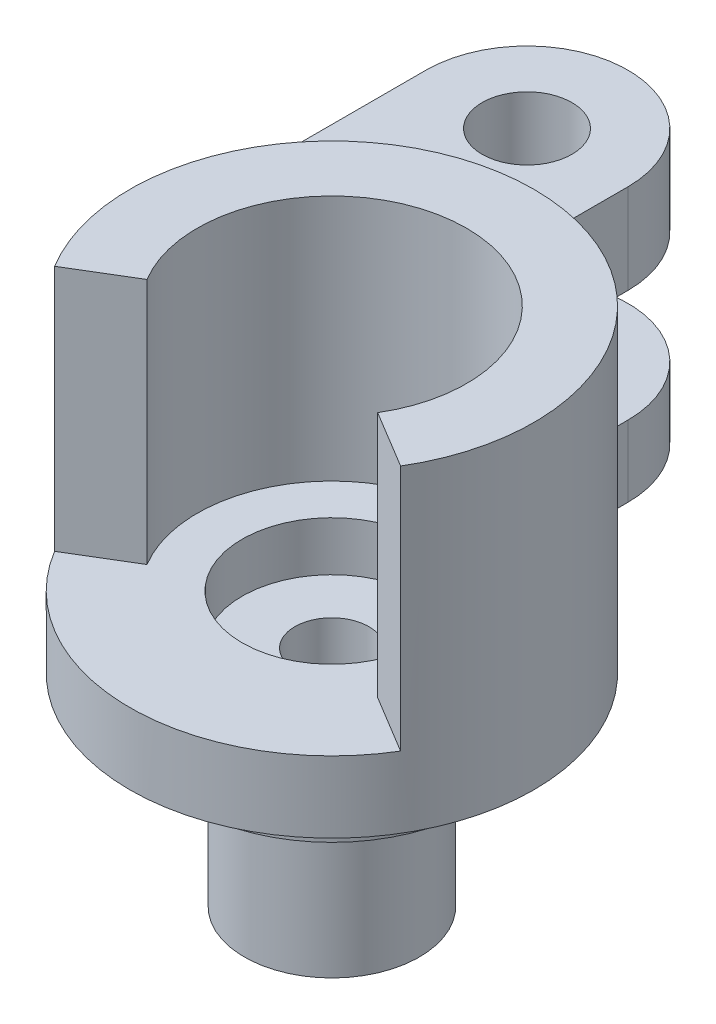
ISO-10303-21;
HEADER;
FILE_DESCRIPTION(('STEP AP214'),'2;1');
FILE_NAME('part.step','',(''),(''),'','','');
FILE_SCHEMA(('AUTOMOTIVE_DESIGN { 1 0 10303 214 1 1 1 1 }'));
ENDSEC;
DATA;
#1=APPLICATION_CONTEXT('core data for automotive mechanical design processes');
#2=APPLICATION_PROTOCOL_DEFINITION('international standard','automotive_design',2000,#1);
#3=PRODUCT_CONTEXT('',#1,'mechanical');
#4=PRODUCT('Part','Part','',(#3));
#5=PRODUCT_RELATED_PRODUCT_CATEGORY('part','',(#4));
#6=PRODUCT_DEFINITION_FORMATION('','',#4);
#7=PRODUCT_DEFINITION_CONTEXT('part definition',#1,'design');
#8=PRODUCT_DEFINITION('design','',#6,#7);
#9=PRODUCT_DEFINITION_SHAPE('','',#8);
#10=(LENGTH_UNIT() NAMED_UNIT(*) SI_UNIT(.MILLI.,.METRE.));
#11=(NAMED_UNIT(*) PLANE_ANGLE_UNIT() SI_UNIT($,.RADIAN.));
#12=(NAMED_UNIT(*) SI_UNIT($,.STERADIAN.) SOLID_ANGLE_UNIT());
#13=UNCERTAINTY_MEASURE_WITH_UNIT(LENGTH_MEASURE(1.E-05),#10,'distance_accuracy_value','');
#14=(GEOMETRIC_REPRESENTATION_CONTEXT(3) GLOBAL_UNCERTAINTY_ASSIGNED_CONTEXT((#13)) GLOBAL_UNIT_ASSIGNED_CONTEXT((#10,
#11,#12)) REPRESENTATION_CONTEXT('',''));
#15=CARTESIAN_POINT('',(0.,0.,0.));
#16=DIRECTION('',(0.,0.,1.));
#17=DIRECTION('',(1.,0.,0.));
#18=AXIS2_PLACEMENT_3D('',#15,#16,#17);
#19=CARTESIAN_POINT('',(0.,-13.6669047975957,0.));
#20=DIRECTION('',(0.,1.,0.));
#21=DIRECTION('',(0.,0.,1.));
#22=AXIS2_PLACEMENT_3D('',#19,#20,#21);
#23=CYLINDRICAL_SURFACE('',#22,1.650000048);
#24=CARTESIAN_POINT('',(0.,-8.999999906,0.));
#25=DIRECTION('',(0.,-1.,0.));
#26=DIRECTION('',(0.,0.,-1.));
#27=AXIS2_PLACEMENT_3D('',#24,#25,#26);
#28=CIRCLE('',#27,1.650000048);
#29=CARTESIAN_POINT('',(0.,-8.999999906,-1.650000048));
#30=VERTEX_POINT('',#29);
#31=EDGE_CURVE('E578',#30,#30,#28,.F.);
#32=ORIENTED_EDGE('',*,*,#31,.F.);
#33=EDGE_LOOP('',(#32));
#34=FACE_BOUND('',#33,.T.);
#35=CARTESIAN_POINT('',(0.,0.975,0.));
#36=DIRECTION('',(0.,1.,0.));
#37=DIRECTION('',(0.,0.,1.));
#38=AXIS2_PLACEMENT_3D('',#35,#36,#37);
#39=CIRCLE('',#38,1.650000048);
#40=CARTESIAN_POINT('',(0.,0.975,1.650000048));
#41=VERTEX_POINT('',#40);
#42=EDGE_CURVE('E41',#41,#41,#39,.F.);
#43=ORIENTED_EDGE('',*,*,#42,.F.);
#44=EDGE_LOOP('',(#43));
#45=FACE_BOUND('',#44,.T.);
#46=ADVANCED_FACE('F37',(#34,#45),#23,.F.);
#47=CARTESIAN_POINT('',(0.,3.175,0.));
#48=DIRECTION('',(0.,-1.,0.));
#49=DIRECTION('',(0.,0.,-1.));
#50=AXIS2_PLACEMENT_3D('',#47,#48,#49);
#51=CYLINDRICAL_SURFACE('',#50,9.);
#52=DIRECTION('',(0.,-1.,0.));
#53=VECTOR('',#52,1.);
#54=CARTESIAN_POINT('',(0.,12.174999906,-9.));
#55=LINE('',#54,#53);
#56=CARTESIAN_POINT('',(0.,12.174999906,-9.));
#57=VERTEX_POINT('',#56);
#58=CARTESIAN_POINT('',(0.,8.174999906,-9.));
#59=VERTEX_POINT('',#58);
#60=EDGE_CURVE('E54',#57,#59,#55,.T.);
#61=ORIENTED_EDGE('',*,*,#60,.F.);
#62=CARTESIAN_POINT('',(0.,12.174999906,0.));
#63=DIRECTION('',(0.,-1.,0.));
#64=DIRECTION('',(0.,0.,1.));
#65=AXIS2_PLACEMENT_3D('',#62,#63,#64);
#66=CIRCLE('',#65,9.);
#67=CARTESIAN_POINT('',(-9.,12.174999906,0.));
#68=VERTEX_POINT('',#67);
#69=EDGE_CURVE('E59',#68,#57,#66,.T.);
#70=ORIENTED_EDGE('',*,*,#69,.F.);
#71=DIRECTION('',(0.,-1.,0.));
#72=VECTOR('',#71,1.);
#73=CARTESIAN_POINT('',(-9.,12.174999906,0.));
#74=LINE('',#73,#72);
#75=CARTESIAN_POINT('',(-9.,8.174999906,0.));
#76=VERTEX_POINT('',#75);
#77=EDGE_CURVE('E147',#68,#76,#74,.T.);
#78=ORIENTED_EDGE('',*,*,#77,.T.);
#79=CARTESIAN_POINT('',(0.,8.174999906,0.));
#80=DIRECTION('',(0.,-1.,0.));
#81=DIRECTION('',(0.,0.,1.));
#82=AXIS2_PLACEMENT_3D('',#79,#80,#81);
#83=CIRCLE('',#82,9.);
#84=EDGE_CURVE('E151',#76,#59,#83,.T.);
#85=ORIENTED_EDGE('',*,*,#84,.T.);
#86=EDGE_LOOP('',(#61,#70,#78,#85));
#87=FACE_BOUND('',#86,.T.);
#88=CARTESIAN_POINT('',(0.,3.175,0.));
#89=DIRECTION('',(0.,1.,0.));
#90=DIRECTION('',(0.,0.,1.));
#91=AXIS2_PLACEMENT_3D('',#88,#89,#90);
#92=CIRCLE('',#91,9.);
#93=CARTESIAN_POINT('',(-7.70770438364841,3.175,4.64664321142554));
#94=VERTEX_POINT('',#93);
#95=CARTESIAN_POINT('',(7.70770438364841,3.175,4.64664321142554));
#96=VERTEX_POINT('',#95);
#97=EDGE_CURVE('E203',#94,#96,#92,.T.);
#98=ORIENTED_EDGE('',*,*,#97,.F.);
#99=DIRECTION('',(0.,-1.,0.));
#100=VECTOR('',#99,1.);
#101=CARTESIAN_POINT('',(-7.70770438364841,14.175,4.64664321142554));
#102=LINE('',#101,#100);
#103=CARTESIAN_POINT('',(-7.70770438364841,14.175,4.64664321142554));
#104=VERTEX_POINT('',#103);
#105=EDGE_CURVE('E230',#104,#94,#102,.T.);
#106=ORIENTED_EDGE('',*,*,#105,.F.);
#107=CARTESIAN_POINT('',(0.,14.175,0.));
#108=DIRECTION('',(0.,1.,0.));
#109=DIRECTION('',(0.,0.,-1.));
#110=AXIS2_PLACEMENT_3D('',#107,#108,#109);
#111=CIRCLE('',#110,9.);
#112=CARTESIAN_POINT('',(7.70770438364841,14.175,4.64664321142554));
#113=VERTEX_POINT('',#112);
#114=EDGE_CURVE('E204',#113,#104,#111,.T.);
#115=ORIENTED_EDGE('',*,*,#114,.F.);
#116=DIRECTION('',(0.,-1.,0.));
#117=VECTOR('',#116,1.);
#118=CARTESIAN_POINT('',(7.70770438364841,14.175,4.64664321142554));
#119=LINE('',#118,#117);
#120=EDGE_CURVE('E214',#113,#96,#119,.T.);
#121=ORIENTED_EDGE('',*,*,#120,.T.);
#122=EDGE_LOOP('',(#98,#106,#115,#121));
#123=FACE_BOUND('',#122,.T.);
#124=DIRECTION('',(0.,-1.,0.));
#125=VECTOR('',#124,1.);
#126=CARTESIAN_POINT('',(0.,23.0265647372949,-9.));
#127=LINE('',#126,#125);
#128=CARTESIAN_POINT('',(0.,3.175,-9.));
#129=VERTEX_POINT('',#128);
#130=CARTESIAN_POINT('',(0.,0.,-9.));
#131=VERTEX_POINT('',#130);
#132=EDGE_CURVE('E176',#129,#131,#127,.T.);
#133=ORIENTED_EDGE('',*,*,#132,.F.);
#134=CARTESIAN_POINT('',(0.,3.175,0.));
#135=DIRECTION('',(0.,1.,0.));
#136=DIRECTION('',(0.,0.,1.));
#137=AXIS2_PLACEMENT_3D('',#134,#135,#136);
#138=CIRCLE('',#137,9.);
#139=CARTESIAN_POINT('',(-9.,3.175,0.));
#140=VERTEX_POINT('',#139);
#141=EDGE_CURVE('E184',#140,#129,#138,.F.);
#142=ORIENTED_EDGE('',*,*,#141,.F.);
#143=DIRECTION('',(0.,-1.,0.));
#144=VECTOR('',#143,1.);
#145=CARTESIAN_POINT('',(-9.,23.0265647372949,0.));
#146=LINE('',#145,#144);
#147=CARTESIAN_POINT('',(-9.,0.,0.));
#148=VERTEX_POINT('',#147);
#149=EDGE_CURVE('E163',#140,#148,#146,.T.);
#150=ORIENTED_EDGE('',*,*,#149,.T.);
#151=CARTESIAN_POINT('',(0.,0.,0.));
#152=DIRECTION('',(0.,1.,0.));
#153=DIRECTION('',(0.,0.,1.));
#154=AXIS2_PLACEMENT_3D('',#151,#152,#153);
#155=CIRCLE('',#154,9.);
#156=EDGE_CURVE('E233',#148,#131,#155,.T.);
#157=ORIENTED_EDGE('',*,*,#156,.T.);
#158=EDGE_LOOP('',(#133,#142,#150,#157));
#159=FACE_BOUND('',#158,.T.);
#160=ADVANCED_FACE('F39',(#87,#123,#159),#51,.T.);
#161=CARTESIAN_POINT('',(0.,3.175,0.));
#162=DIRECTION('',(0.,1.,0.));
#163=DIRECTION('',(0.,0.,1.));
#164=AXIS2_PLACEMENT_3D('',#161,#162,#163);
#165=PLANE('',#164);
#166=CARTESIAN_POINT('',(0.,3.175,0.));
#167=DIRECTION('',(0.,1.,0.));
#168=DIRECTION('',(0.,0.,1.));
#169=AXIS2_PLACEMENT_3D('',#166,#167,#168);
#170=CIRCLE('',#169,4.);
#171=CARTESIAN_POINT('',(0.,3.175,4.));
#172=VERTEX_POINT('',#171);
#173=EDGE_CURVE('E557',#172,#172,#170,.T.);
#174=ORIENTED_EDGE('',*,*,#173,.F.);
#175=EDGE_LOOP('',(#174));
#176=FACE_BOUND('',#175,.T.);
#177=DIRECTION('',(0.856411598183157,0.,0.516293690158394));
#178=VECTOR('',#177,1.);
#179=CARTESIAN_POINT('',(5.13846958909894,3.175,3.09776214095036));
#180=LINE('',#179,#178);
#181=CARTESIAN_POINT('',(5.13846958909894,3.175,3.09776214095036));
#182=VERTEX_POINT('',#181);
#183=EDGE_CURVE('E208',#182,#96,#180,.T.);
#184=ORIENTED_EDGE('',*,*,#183,.F.);
#185=CARTESIAN_POINT('',(0.,3.175,0.));
#186=DIRECTION('',(0.,-1.,0.));
#187=DIRECTION('',(0.,0.,-1.));
#188=AXIS2_PLACEMENT_3D('',#185,#186,#187);
#189=CIRCLE('',#188,6.);
#190=CARTESIAN_POINT('',(-5.13846958909894,3.175,3.09776214095036));
#191=VERTEX_POINT('',#190);
#192=EDGE_CURVE('E217',#191,#182,#189,.T.);
#193=ORIENTED_EDGE('',*,*,#192,.F.);
#194=DIRECTION('',(0.856411598183157,0.,-0.516293690158393));
#195=VECTOR('',#194,1.);
#196=CARTESIAN_POINT('',(-7.70770438364841,3.175,4.64664321142554));
#197=LINE('',#196,#195);
#198=EDGE_CURVE('E200',#94,#191,#197,.T.);
#199=ORIENTED_EDGE('',*,*,#198,.F.);
#200=ORIENTED_EDGE('',*,*,#97,.T.);
#201=EDGE_LOOP('',(#184,#193,#199,#200));
#202=FACE_BOUND('',#201,.T.);
#203=ADVANCED_FACE('F270',(#176,#202),#165,.T.);
#204=CARTESIAN_POINT('',(0.,0.,0.));
#205=DIRECTION('',(0.,1.,0.));
#206=DIRECTION('',(0.,0.,1.));
#207=AXIS2_PLACEMENT_3D('',#204,#205,#206);
#208=PLANE('',#207);
#209=CARTESIAN_POINT('',(0.,0.,0.));
#210=DIRECTION('',(0.,-1.,0.));
#211=DIRECTION('',(0.,0.,-1.));
#212=AXIS2_PLACEMENT_3D('',#209,#210,#211);
#213=CIRCLE('',#212,6.399999954);
#214=CARTESIAN_POINT('',(0.,0.,-6.399999954));
#215=VERTEX_POINT('',#214);
#216=EDGE_CURVE('E46',#215,#215,#213,.T.);
#217=ORIENTED_EDGE('',*,*,#216,.F.);
#218=EDGE_LOOP('',(#217));
#219=FACE_BOUND('',#218,.T.);
#220=ORIENTED_EDGE('',*,*,#156,.F.);
#221=DIRECTION('',(0.,0.,1.));
#222=VECTOR('',#221,1.);
#223=CARTESIAN_POINT('',(-9.,0.,0.));
#224=LINE('',#223,#222);
#225=CARTESIAN_POINT('',(-9.,0.,-13.1941974251168));
#226=VERTEX_POINT('',#225);
#227=EDGE_CURVE('E164',#226,#148,#224,.T.);
#228=ORIENTED_EDGE('',*,*,#227,.F.);
#229=CARTESIAN_POINT('',(-4.5,0.,-13.1941974251168));
#230=DIRECTION('',(0.,1.,0.));
#231=DIRECTION('',(0.,0.,1.));
#232=AXIS2_PLACEMENT_3D('',#229,#230,#231);
#233=CIRCLE('',#232,4.5);
#234=CARTESIAN_POINT('',(0.,0.,-13.1941974251168));
#235=VERTEX_POINT('',#234);
#236=EDGE_CURVE('E169',#235,#226,#233,.T.);
#237=ORIENTED_EDGE('',*,*,#236,.F.);
#238=DIRECTION('',(0.,0.,-1.));
#239=VECTOR('',#238,1.);
#240=CARTESIAN_POINT('',(0.,0.,-9.));
#241=LINE('',#240,#239);
#242=EDGE_CURVE('E173',#131,#235,#241,.T.);
#243=ORIENTED_EDGE('',*,*,#242,.F.);
#244=EDGE_LOOP('',(#220,#228,#237,#243));
#245=FACE_BOUND('',#244,.T.);
#246=ADVANCED_FACE('F244',(#219,#245),#208,.F.);
#247=CARTESIAN_POINT('',(-7.70770438364841,14.175,4.64664321142554));
#248=DIRECTION('',(-0.516293690158393,0.,-0.856411598183157));
#249=DIRECTION('',(-0.856411598183157,0.,0.516293690158393));
#250=AXIS2_PLACEMENT_3D('',#247,#248,#249);
#251=PLANE('',#250);
#252=ORIENTED_EDGE('',*,*,#198,.T.);
#253=DIRECTION('',(0.,-1.,0.));
#254=VECTOR('',#253,1.);
#255=CARTESIAN_POINT('',(-5.13846958909894,14.175,3.09776214095036));
#256=LINE('',#255,#254);
#257=CARTESIAN_POINT('',(-5.13846958909894,14.175,3.09776214095036));
#258=VERTEX_POINT('',#257);
#259=EDGE_CURVE('E227',#258,#191,#256,.T.);
#260=ORIENTED_EDGE('',*,*,#259,.F.);
#261=DIRECTION('',(0.856411598183157,0.,-0.516293690158393));
#262=VECTOR('',#261,1.);
#263=CARTESIAN_POINT('',(-7.70770438364841,14.175,4.64664321142554));
#264=LINE('',#263,#262);
#265=EDGE_CURVE('E207',#104,#258,#264,.T.);
#266=ORIENTED_EDGE('',*,*,#265,.F.);
#267=ORIENTED_EDGE('',*,*,#105,.T.);
#268=EDGE_LOOP('',(#252,#260,#266,#267));
#269=FACE_BOUND('',#268,.T.);
#270=ADVANCED_FACE('F432',(#269),#251,.F.);
#271=CARTESIAN_POINT('',(0.,14.175,0.));
#272=DIRECTION('',(0.,-1.,0.));
#273=DIRECTION('',(0.,0.,-1.));
#274=AXIS2_PLACEMENT_3D('',#271,#272,#273);
#275=CYLINDRICAL_SURFACE('',#274,6.);
#276=ORIENTED_EDGE('',*,*,#192,.T.);
#277=DIRECTION('',(0.,-1.,0.));
#278=VECTOR('',#277,1.);
#279=CARTESIAN_POINT('',(5.13846958909894,14.175,3.09776214095036));
#280=LINE('',#279,#278);
#281=CARTESIAN_POINT('',(5.13846958909894,14.175,3.09776214095036));
#282=VERTEX_POINT('',#281);
#283=EDGE_CURVE('E224',#282,#182,#280,.T.);
#284=ORIENTED_EDGE('',*,*,#283,.F.);
#285=CARTESIAN_POINT('',(0.,14.175,0.));
#286=DIRECTION('',(0.,-1.,0.));
#287=DIRECTION('',(0.,0.,-1.));
#288=AXIS2_PLACEMENT_3D('',#285,#286,#287);
#289=CIRCLE('',#288,6.);
#290=EDGE_CURVE('E210',#258,#282,#289,.T.);
#291=ORIENTED_EDGE('',*,*,#290,.F.);
#292=ORIENTED_EDGE('',*,*,#259,.T.);
#293=EDGE_LOOP('',(#276,#284,#291,#292));
#294=FACE_BOUND('',#293,.T.);
#295=ADVANCED_FACE('F501',(#294),#275,.F.);
#296=CARTESIAN_POINT('',(5.13846958909894,14.175,3.09776214095036));
#297=DIRECTION('',(0.516293690158394,0.,-0.856411598183157));
#298=DIRECTION('',(-0.856411598183157,0.,-0.516293690158394));
#299=AXIS2_PLACEMENT_3D('',#296,#297,#298);
#300=PLANE('',#299);
#301=ORIENTED_EDGE('',*,*,#183,.T.);
#302=ORIENTED_EDGE('',*,*,#120,.F.);
#303=DIRECTION('',(0.856411598183157,0.,0.516293690158394));
#304=VECTOR('',#303,1.);
#305=CARTESIAN_POINT('',(5.13846958909894,14.175,3.09776214095036));
#306=LINE('',#305,#304);
#307=EDGE_CURVE('E212',#282,#113,#306,.T.);
#308=ORIENTED_EDGE('',*,*,#307,.F.);
#309=ORIENTED_EDGE('',*,*,#283,.T.);
#310=EDGE_LOOP('',(#301,#302,#308,#309));
#311=FACE_BOUND('',#310,.T.);
#312=ADVANCED_FACE('F491',(#311),#300,.F.);
#313=CARTESIAN_POINT('',(0.,14.175,0.));
#314=DIRECTION('',(0.,-1.,0.));
#315=DIRECTION('',(0.,0.,-1.));
#316=AXIS2_PLACEMENT_3D('',#313,#314,#315);
#317=PLANE('',#316);
#318=ORIENTED_EDGE('',*,*,#114,.T.);
#319=ORIENTED_EDGE('',*,*,#265,.T.);
#320=ORIENTED_EDGE('',*,*,#290,.T.);
#321=ORIENTED_EDGE('',*,*,#307,.T.);
#322=EDGE_LOOP('',(#318,#319,#320,#321));
#323=FACE_BOUND('',#322,.T.);
#324=ADVANCED_FACE('F481',(#323),#317,.F.);
#325=CARTESIAN_POINT('',(0.,-2.,0.));
#326=DIRECTION('',(0.,1.,0.));
#327=DIRECTION('',(0.,0.,1.));
#328=AXIS2_PLACEMENT_3D('',#325,#326,#327);
#329=CYLINDRICAL_SURFACE('',#328,6.399999954);
#330=CARTESIAN_POINT('',(0.,-2.,0.));
#331=DIRECTION('',(0.,-1.,0.));
#332=DIRECTION('',(0.,0.,-1.));
#333=AXIS2_PLACEMENT_3D('',#330,#331,#332);
#334=CIRCLE('',#333,6.399999954);
#335=CARTESIAN_POINT('',(0.,-2.,-6.399999954));
#336=VERTEX_POINT('',#335);
#337=EDGE_CURVE('E196',#336,#336,#334,.T.);
#338=ORIENTED_EDGE('',*,*,#337,.F.);
#339=EDGE_LOOP('',(#338));
#340=FACE_BOUND('',#339,.T.);
#341=ORIENTED_EDGE('',*,*,#216,.T.);
#342=EDGE_LOOP('',(#341));
#343=FACE_BOUND('',#342,.T.);
#344=ADVANCED_FACE('F471',(#340,#343),#329,.T.);
#345=CARTESIAN_POINT('',(0.,-2.,0.));
#346=DIRECTION('',(0.,-1.,0.));
#347=DIRECTION('',(0.,0.,-1.));
#348=AXIS2_PLACEMENT_3D('',#345,#346,#347);
#349=PLANE('',#348);
#350=CARTESIAN_POINT('',(0.,-2.,0.));
#351=DIRECTION('',(0.,-1.,0.));
#352=DIRECTION('',(0.,0.,-1.));
#353=AXIS2_PLACEMENT_3D('',#350,#351,#352);
#354=CIRCLE('',#353,3.899999974);
#355=CARTESIAN_POINT('',(0.,-2.,-3.899999974));
#356=VERTEX_POINT('',#355);
#357=EDGE_CURVE('E11',#356,#356,#354,.T.);
#358=ORIENTED_EDGE('',*,*,#357,.F.);
#359=EDGE_LOOP('',(#358));
#360=FACE_BOUND('',#359,.T.);
#361=ORIENTED_EDGE('',*,*,#337,.T.);
#362=EDGE_LOOP('',(#361));
#363=FACE_BOUND('',#362,.T.);
#364=ADVANCED_FACE('F462',(#360,#363),#349,.T.);
#365=CARTESIAN_POINT('',(0.,-8.999999906,0.));
#366=DIRECTION('',(0.,1.,0.));
#367=DIRECTION('',(0.,0.,1.));
#368=AXIS2_PLACEMENT_3D('',#365,#366,#367);
#369=CYLINDRICAL_SURFACE('',#368,3.899999974);
#370=CARTESIAN_POINT('',(0.,-8.999999906,0.));
#371=DIRECTION('',(0.,-1.,0.));
#372=DIRECTION('',(0.,0.,-1.));
#373=AXIS2_PLACEMENT_3D('',#370,#371,#372);
#374=CIRCLE('',#373,3.899999974);
#375=CARTESIAN_POINT('',(0.,-8.999999906,-3.899999974));
#376=VERTEX_POINT('',#375);
#377=EDGE_CURVE('E180',#376,#376,#374,.T.);
#378=ORIENTED_EDGE('',*,*,#377,.F.);
#379=EDGE_LOOP('',(#378));
#380=FACE_BOUND('',#379,.T.);
#381=ORIENTED_EDGE('',*,*,#357,.T.);
#382=EDGE_LOOP('',(#381));
#383=FACE_BOUND('',#382,.T.);
#384=ADVANCED_FACE('F453',(#380,#383),#369,.T.);
#385=CARTESIAN_POINT('',(0.,-8.999999906,0.));
#386=DIRECTION('',(0.,-1.,0.));
#387=DIRECTION('',(0.,0.,-1.));
#388=AXIS2_PLACEMENT_3D('',#385,#386,#387);
#389=PLANE('',#388);
#390=ORIENTED_EDGE('',*,*,#31,.T.);
#391=EDGE_LOOP('',(#390));
#392=FACE_BOUND('',#391,.T.);
#393=ORIENTED_EDGE('',*,*,#377,.T.);
#394=EDGE_LOOP('',(#393));
#395=FACE_BOUND('',#394,.T.);
#396=ADVANCED_FACE('F422',(#392,#395),#389,.T.);
#397=CARTESIAN_POINT('',(0.,23.0265647372949,-9.));
#398=DIRECTION('',(-1.,0.,0.));
#399=DIRECTION('',(0.,0.,1.));
#400=AXIS2_PLACEMENT_3D('',#397,#398,#399);
#401=PLANE('',#400);
#402=DIRECTION('',(0.,0.,-1.));
#403=VECTOR('',#402,1.);
#404=CARTESIAN_POINT('',(0.,3.175,-9.));
#405=LINE('',#404,#403);
#406=CARTESIAN_POINT('',(0.,3.175,-13.1941974251168));
#407=VERTEX_POINT('',#406);
#408=EDGE_CURVE('E181',#129,#407,#405,.T.);
#409=ORIENTED_EDGE('',*,*,#408,.F.);
#410=ORIENTED_EDGE('',*,*,#132,.T.);
#411=ORIENTED_EDGE('',*,*,#242,.T.);
#412=DIRECTION('',(0.,-1.,0.));
#413=VECTOR('',#412,1.);
#414=CARTESIAN_POINT('',(0.,23.0265647372949,-13.1941974251168));
#415=LINE('',#414,#413);
#416=EDGE_CURVE('E172',#407,#235,#415,.T.);
#417=ORIENTED_EDGE('',*,*,#416,.F.);
#418=EDGE_LOOP('',(#409,#410,#411,#417));
#419=FACE_BOUND('',#418,.T.);
#420=ADVANCED_FACE('F241',(#419),#401,.F.);
#421=CARTESIAN_POINT('',(-4.5,23.0265647372949,-13.1941974251168));
#422=DIRECTION('',(0.,-1.,0.));
#423=DIRECTION('',(0.,0.,-1.));
#424=AXIS2_PLACEMENT_3D('',#421,#422,#423);
#425=CYLINDRICAL_SURFACE('',#424,4.5);
#426=CARTESIAN_POINT('',(-4.5,3.175,-13.1941974251168));
#427=DIRECTION('',(0.,1.,0.));
#428=DIRECTION('',(0.,0.,1.));
#429=AXIS2_PLACEMENT_3D('',#426,#427,#428);
#430=CIRCLE('',#429,4.5);
#431=CARTESIAN_POINT('',(-9.,3.175,-13.1941974251168));
#432=VERTEX_POINT('',#431);
#433=EDGE_CURVE('E177',#407,#432,#430,.T.);
#434=ORIENTED_EDGE('',*,*,#433,.F.);
#435=ORIENTED_EDGE('',*,*,#416,.T.);
#436=ORIENTED_EDGE('',*,*,#236,.T.);
#437=DIRECTION('',(0.,-1.,0.));
#438=VECTOR('',#437,1.);
#439=CARTESIAN_POINT('',(-9.,23.0265647372949,-13.1941974251168));
#440=LINE('',#439,#438);
#441=EDGE_CURVE('E168',#432,#226,#440,.T.);
#442=ORIENTED_EDGE('',*,*,#441,.F.);
#443=EDGE_LOOP('',(#434,#435,#436,#442));
#444=FACE_BOUND('',#443,.T.);
#445=ADVANCED_FACE('F246',(#444),#425,.T.);
#446=CARTESIAN_POINT('',(-9.,23.0265647372949,0.));
#447=DIRECTION('',(1.,0.,0.));
#448=DIRECTION('',(0.,0.,-1.));
#449=AXIS2_PLACEMENT_3D('',#446,#447,#448);
#450=PLANE('',#449);
#451=DIRECTION('',(0.,0.,1.));
#452=VECTOR('',#451,1.);
#453=CARTESIAN_POINT('',(-9.,3.175,0.));
#454=LINE('',#453,#452);
#455=EDGE_CURVE('E167',#432,#140,#454,.T.);
#456=ORIENTED_EDGE('',*,*,#455,.F.);
#457=ORIENTED_EDGE('',*,*,#441,.T.);
#458=ORIENTED_EDGE('',*,*,#227,.T.);
#459=ORIENTED_EDGE('',*,*,#149,.F.);
#460=EDGE_LOOP('',(#456,#457,#458,#459));
#461=FACE_BOUND('',#460,.T.);
#462=ADVANCED_FACE('F251',(#461),#450,.F.);
#463=CARTESIAN_POINT('',(0.,3.175,0.));
#464=DIRECTION('',(0.,1.,0.));
#465=DIRECTION('',(0.,0.,1.));
#466=AXIS2_PLACEMENT_3D('',#463,#464,#465);
#467=PLANE('',#466);
#468=CARTESIAN_POINT('',(-4.5,3.175,-13.1941974251168));
#469=DIRECTION('',(0.,1.,0.));
#470=DIRECTION('',(0.,0.,1.));
#471=AXIS2_PLACEMENT_3D('',#468,#469,#470);
#472=CIRCLE('',#471,1.7145);
#473=CARTESIAN_POINT('',(-4.5,3.175,-11.4796974251168));
#474=VERTEX_POINT('',#473);
#475=EDGE_CURVE('E574',#474,#474,#472,.T.);
#476=ORIENTED_EDGE('',*,*,#475,.F.);
#477=EDGE_LOOP('',(#476));
#478=FACE_BOUND('',#477,.T.);
#479=ORIENTED_EDGE('',*,*,#455,.T.);
#480=ORIENTED_EDGE('',*,*,#141,.T.);
#481=ORIENTED_EDGE('',*,*,#408,.T.);
#482=ORIENTED_EDGE('',*,*,#433,.T.);
#483=EDGE_LOOP('',(#479,#480,#481,#482));
#484=FACE_BOUND('',#483,.T.);
#485=ADVANCED_FACE('F249',(#478,#484),#467,.T.);
#486=CARTESIAN_POINT('',(0.,12.174999906,-9.));
#487=DIRECTION('',(-1.,0.,0.));
#488=DIRECTION('',(0.,0.,1.));
#489=AXIS2_PLACEMENT_3D('',#486,#487,#488);
#490=PLANE('',#489);
#491=DIRECTION('',(0.,0.,-1.));
#492=VECTOR('',#491,1.);
#493=CARTESIAN_POINT('',(0.,8.174999906,-9.));
#494=LINE('',#493,#492);
#495=CARTESIAN_POINT('',(0.,8.174999906,-13.1941974251168));
#496=VERTEX_POINT('',#495);
#497=EDGE_CURVE('E137',#59,#496,#494,.T.);
#498=ORIENTED_EDGE('',*,*,#497,.T.);
#499=DIRECTION('',(0.,-1.,0.));
#500=VECTOR('',#499,1.);
#501=CARTESIAN_POINT('',(0.,12.174999906,-13.1941974251168));
#502=LINE('',#501,#500);
#503=CARTESIAN_POINT('',(0.,12.174999906,-13.1941974251168));
#504=VERTEX_POINT('',#503);
#505=EDGE_CURVE('E134',#504,#496,#502,.T.);
#506=ORIENTED_EDGE('',*,*,#505,.F.);
#507=DIRECTION('',(0.,0.,-1.));
#508=VECTOR('',#507,1.);
#509=CARTESIAN_POINT('',(0.,12.174999906,-9.));
#510=LINE('',#509,#508);
#511=EDGE_CURVE('E125',#57,#504,#510,.T.);
#512=ORIENTED_EDGE('',*,*,#511,.F.);
#513=ORIENTED_EDGE('',*,*,#60,.T.);
#514=EDGE_LOOP('',(#498,#506,#512,#513));
#515=FACE_BOUND('',#514,.T.);
#516=ADVANCED_FACE('F135',(#515),#490,.F.);
#517=CARTESIAN_POINT('',(-4.5,12.174999906,-13.1941974251168));
#518=DIRECTION('',(0.,-1.,0.));
#519=DIRECTION('',(0.,0.,-1.));
#520=AXIS2_PLACEMENT_3D('',#517,#518,#519);
#521=CYLINDRICAL_SURFACE('',#520,4.5);
#522=CARTESIAN_POINT('',(-4.5,8.174999906,-13.1941974251168));
#523=DIRECTION('',(0.,1.,0.));
#524=DIRECTION('',(0.,0.,1.));
#525=AXIS2_PLACEMENT_3D('',#522,#523,#524);
#526=CIRCLE('',#525,4.5);
#527=CARTESIAN_POINT('',(-9.,8.174999906,-13.1941974251168));
#528=VERTEX_POINT('',#527);
#529=EDGE_CURVE('E155',#496,#528,#526,.T.);
#530=ORIENTED_EDGE('',*,*,#529,.T.);
#531=DIRECTION('',(0.,-1.,0.));
#532=VECTOR('',#531,1.);
#533=CARTESIAN_POINT('',(-9.,12.174999906,-13.1941974251168));
#534=LINE('',#533,#532);
#535=CARTESIAN_POINT('',(-9.,12.174999906,-13.1941974251168));
#536=VERTEX_POINT('',#535);
#537=EDGE_CURVE('E140',#536,#528,#534,.T.);
#538=ORIENTED_EDGE('',*,*,#537,.F.);
#539=CARTESIAN_POINT('',(-4.5,12.174999906,-13.1941974251168));
#540=DIRECTION('',(0.,1.,0.));
#541=DIRECTION('',(0.,0.,1.));
#542=AXIS2_PLACEMENT_3D('',#539,#540,#541);
#543=CIRCLE('',#542,4.5);
#544=EDGE_CURVE('E129',#504,#536,#543,.T.);
#545=ORIENTED_EDGE('',*,*,#544,.F.);
#546=ORIENTED_EDGE('',*,*,#505,.T.);
#547=EDGE_LOOP('',(#530,#538,#545,#546));
#548=FACE_BOUND('',#547,.T.);
#549=ADVANCED_FACE('F142',(#548),#521,.T.);
#550=CARTESIAN_POINT('',(-9.,12.174999906,-13.1941974251168));
#551=DIRECTION('',(1.,0.,0.));
#552=DIRECTION('',(0.,0.,-1.));
#553=AXIS2_PLACEMENT_3D('',#550,#551,#552);
#554=PLANE('',#553);
#555=DIRECTION('',(0.,0.,1.));
#556=VECTOR('',#555,1.);
#557=CARTESIAN_POINT('',(-9.,8.174999906,-13.1941974251168));
#558=LINE('',#557,#556);
#559=EDGE_CURVE('E157',#528,#76,#558,.T.);
#560=ORIENTED_EDGE('',*,*,#559,.T.);
#561=ORIENTED_EDGE('',*,*,#77,.F.);
#562=DIRECTION('',(0.,0.,1.));
#563=VECTOR('',#562,1.);
#564=CARTESIAN_POINT('',(-9.,12.174999906,-13.1941974251168));
#565=LINE('',#564,#563);
#566=EDGE_CURVE('E145',#536,#68,#565,.T.);
#567=ORIENTED_EDGE('',*,*,#566,.F.);
#568=ORIENTED_EDGE('',*,*,#537,.T.);
#569=EDGE_LOOP('',(#560,#561,#567,#568));
#570=FACE_BOUND('',#569,.T.);
#571=ADVANCED_FACE('F285',(#570),#554,.F.);
#572=CARTESIAN_POINT('',(0.,12.174999906,0.));
#573=DIRECTION('',(0.,1.,0.));
#574=DIRECTION('',(0.,0.,1.));
#575=AXIS2_PLACEMENT_3D('',#572,#573,#574);
#576=PLANE('',#575);
#577=CARTESIAN_POINT('',(-4.5,12.174999906,-13.1941974251168));
#578=DIRECTION('',(0.,1.,0.));
#579=DIRECTION('',(0.,0.,1.));
#580=AXIS2_PLACEMENT_3D('',#577,#578,#579);
#581=CIRCLE('',#580,2.);
#582=CARTESIAN_POINT('',(-4.5,12.174999906,-11.1941974251168));
#583=VERTEX_POINT('',#582);
#584=EDGE_CURVE('E581',#583,#583,#581,.T.);
#585=ORIENTED_EDGE('',*,*,#584,.F.);
#586=EDGE_LOOP('',(#585));
#587=FACE_BOUND('',#586,.T.);
#588=ORIENTED_EDGE('',*,*,#69,.T.);
#589=ORIENTED_EDGE('',*,*,#511,.T.);
#590=ORIENTED_EDGE('',*,*,#544,.T.);
#591=ORIENTED_EDGE('',*,*,#566,.T.);
#592=EDGE_LOOP('',(#588,#589,#590,#591));
#593=FACE_BOUND('',#592,.T.);
#594=ADVANCED_FACE('F127',(#587,#593),#576,.T.);
#595=CARTESIAN_POINT('',(0.,8.174999906,0.));
#596=DIRECTION('',(0.,1.,0.));
#597=DIRECTION('',(0.,0.,1.));
#598=AXIS2_PLACEMENT_3D('',#595,#596,#597);
#599=PLANE('',#598);
#600=CARTESIAN_POINT('',(-4.5,8.174999906,-13.1941974251168));
#601=DIRECTION('',(0.,1.,0.));
#602=DIRECTION('',(0.,0.,1.));
#603=AXIS2_PLACEMENT_3D('',#600,#601,#602);
#604=CIRCLE('',#603,2.);
#605=CARTESIAN_POINT('',(-4.5,8.174999906,-11.1941974251168));
#606=VERTEX_POINT('',#605);
#607=EDGE_CURVE('E153',#606,#606,#604,.F.);
#608=ORIENTED_EDGE('',*,*,#607,.F.);
#609=EDGE_LOOP('',(#608));
#610=FACE_BOUND('',#609,.T.);
#611=ORIENTED_EDGE('',*,*,#84,.F.);
#612=ORIENTED_EDGE('',*,*,#559,.F.);
#613=ORIENTED_EDGE('',*,*,#529,.F.);
#614=ORIENTED_EDGE('',*,*,#497,.F.);
#615=EDGE_LOOP('',(#611,#612,#613,#614));
#616=FACE_BOUND('',#615,.T.);
#617=ADVANCED_FACE('F281',(#610,#616),#599,.F.);
#618=CARTESIAN_POINT('',(-4.5,2.51814565650762,-13.1941974251168));
#619=DIRECTION('',(0.,1.,0.));
#620=DIRECTION('',(0.,0.,1.));
#621=AXIS2_PLACEMENT_3D('',#618,#619,#620);
#622=CYLINDRICAL_SURFACE('',#621,2.);
#623=ORIENTED_EDGE('',*,*,#607,.T.);
#624=EDGE_LOOP('',(#623));
#625=FACE_BOUND('',#624,.T.);
#626=ORIENTED_EDGE('',*,*,#584,.T.);
#627=EDGE_LOOP('',(#626));
#628=FACE_BOUND('',#627,.T.);
#629=ADVANCED_FACE('F277',(#625,#628),#622,.F.);
#630=CARTESIAN_POINT('',(0.,0.975,0.));
#631=DIRECTION('',(0.,1.,0.));
#632=DIRECTION('',(0.,0.,1.));
#633=AXIS2_PLACEMENT_3D('',#630,#631,#632);
#634=PLANE('',#633);
#635=CARTESIAN_POINT('',(0.,0.975,0.));
#636=DIRECTION('',(0.,1.,0.));
#637=DIRECTION('',(0.,0.,1.));
#638=AXIS2_PLACEMENT_3D('',#635,#636,#637);
#639=CIRCLE('',#638,4.);
#640=CARTESIAN_POINT('',(0.,0.975,4.));
#641=VERTEX_POINT('',#640);
#642=EDGE_CURVE('E568',#641,#641,#639,.T.);
#643=ORIENTED_EDGE('',*,*,#642,.T.);
#644=EDGE_LOOP('',(#643));
#645=FACE_BOUND('',#644,.T.);
#646=ORIENTED_EDGE('',*,*,#42,.T.);
#647=EDGE_LOOP('',(#646));
#648=FACE_BOUND('',#647,.T.);
#649=ADVANCED_FACE('F280',(#645,#648),#634,.T.);
#650=CARTESIAN_POINT('',(0.,0.975,0.));
#651=DIRECTION('',(0.,1.,0.));
#652=DIRECTION('',(0.,0.,1.));
#653=AXIS2_PLACEMENT_3D('',#650,#651,#652);
#654=CYLINDRICAL_SURFACE('',#653,4.);
#655=ORIENTED_EDGE('',*,*,#642,.F.);
#656=EDGE_LOOP('',(#655));
#657=FACE_BOUND('',#656,.T.);
#658=ORIENTED_EDGE('',*,*,#173,.T.);
#659=EDGE_LOOP('',(#658));
#660=FACE_BOUND('',#659,.T.);
#661=ADVANCED_FACE('F275',(#657,#660),#654,.F.);
#662=CARTESIAN_POINT('',(-4.5,1.675,-13.1941974251168));
#663=DIRECTION('',(0.,1.,0.));
#664=DIRECTION('',(0.,0.,1.));
#665=AXIS2_PLACEMENT_3D('',#662,#663,#664);
#666=CYLINDRICAL_SURFACE('',#665,1.7145);
#667=CARTESIAN_POINT('',(-4.5,1.675,-13.1941974251168));
#668=DIRECTION('',(0.,1.,0.));
#669=DIRECTION('',(0.,0.,1.));
#670=AXIS2_PLACEMENT_3D('',#667,#668,#669);
#671=CIRCLE('',#670,1.7145);
#672=CARTESIAN_POINT('',(-4.5,1.675,-11.4796974251168));
#673=VERTEX_POINT('',#672);
#674=EDGE_CURVE('E569',#673,#673,#671,.T.);
#675=ORIENTED_EDGE('',*,*,#674,.F.);
#676=EDGE_LOOP('',(#675));
#677=FACE_BOUND('',#676,.T.);
#678=ORIENTED_EDGE('',*,*,#475,.T.);
#679=EDGE_LOOP('',(#678));
#680=FACE_BOUND('',#679,.T.);
#681=ADVANCED_FACE('F333',(#677,#680),#666,.F.);
#682=CARTESIAN_POINT('',(-4.5,1.675,-13.1941974251168));
#683=DIRECTION('',(0.,1.,0.));
#684=DIRECTION('',(0.,0.,1.));
#685=AXIS2_PLACEMENT_3D('',#682,#683,#684);
#686=PLANE('',#685);
#687=ORIENTED_EDGE('',*,*,#674,.T.);
#688=EDGE_LOOP('',(#687));
#689=FACE_BOUND('',#688,.T.);
#690=ADVANCED_FACE('F340',(#689),#686,.T.);
#691=CLOSED_SHELL('',(#46,#160,#203,#246,#270,#295,#312,#324,#344,#364,#384,#396,#420,#445,#462,
#485,#516,#549,#571,#594,#617,#629,#649,#661,#681,#690));
#692=MANIFOLD_SOLID_BREP('B2',#691);
#693=ADVANCED_BREP_SHAPE_REPRESENTATION('',(#18,#692),#14);
#694=SHAPE_DEFINITION_REPRESENTATION(#9,#693);
ENDSEC;
END-ISO-10303-21;
